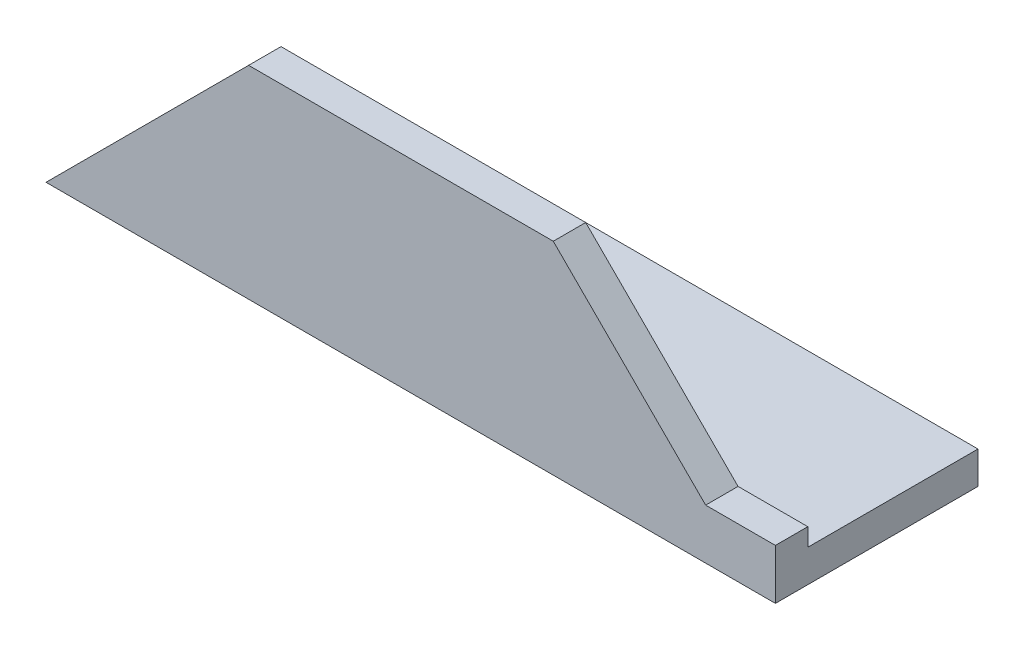
ISO-10303-21;
HEADER;
FILE_DESCRIPTION(('STEP AP214'),'2;1');
FILE_NAME('part.step','',(''),(''),'','','');
FILE_SCHEMA(('AUTOMOTIVE_DESIGN { 1 0 10303 214 1 1 1 1 }'));
ENDSEC;
DATA;
#1=APPLICATION_CONTEXT('core data for automotive mechanical design processes');
#2=APPLICATION_PROTOCOL_DEFINITION('international standard','automotive_design',2000,#1);
#3=PRODUCT_CONTEXT('',#1,'mechanical');
#4=PRODUCT('Part','Part','',(#3));
#5=PRODUCT_RELATED_PRODUCT_CATEGORY('part','',(#4));
#6=PRODUCT_DEFINITION_FORMATION('','',#4);
#7=PRODUCT_DEFINITION_CONTEXT('part definition',#1,'design');
#8=PRODUCT_DEFINITION('design','',#6,#7);
#9=PRODUCT_DEFINITION_SHAPE('','',#8);
#10=(LENGTH_UNIT() NAMED_UNIT(*) SI_UNIT(.MILLI.,.METRE.));
#11=(NAMED_UNIT(*) PLANE_ANGLE_UNIT() SI_UNIT($,.RADIAN.));
#12=(NAMED_UNIT(*) SI_UNIT($,.STERADIAN.) SOLID_ANGLE_UNIT());
#13=UNCERTAINTY_MEASURE_WITH_UNIT(LENGTH_MEASURE(1.E-05),#10,'distance_accuracy_value','');
#14=(GEOMETRIC_REPRESENTATION_CONTEXT(3) GLOBAL_UNCERTAINTY_ASSIGNED_CONTEXT((#13)) GLOBAL_UNIT_ASSIGNED_CONTEXT((#10,
#11,#12)) REPRESENTATION_CONTEXT('',''));
#15=CARTESIAN_POINT('',(0.,0.,0.));
#16=DIRECTION('',(0.,0.,1.));
#17=DIRECTION('',(1.,0.,0.));
#18=AXIS2_PLACEMENT_3D('',#15,#16,#17);
#19=CARTESIAN_POINT('',(90.,0.,-4.));
#20=DIRECTION('',(0.,0.,1.));
#21=DIRECTION('',(1.,0.,0.));
#22=AXIS2_PLACEMENT_3D('',#19,#20,#21);
#23=PLANE('',#22);
#24=DIRECTION('',(0.707106781186547,-0.707106781186547,0.));
#25=VECTOR('',#24,1.);
#26=CARTESIAN_POINT('',(88.7969572735896,-1.20304272641038,-4.));
#27=LINE('',#26,#25);
#28=CARTESIAN_POINT('',(62.5939145471792,25.,-4.));
#29=VERTEX_POINT('',#28);
#30=CARTESIAN_POINT('',(81.3946108479675,6.19930369921177,-4.));
#31=VERTEX_POINT('',#30);
#32=EDGE_CURVE('E166',#29,#31,#27,.T.);
#33=ORIENTED_EDGE('',*,*,#32,.T.);
#34=DIRECTION('',(1.,0.,0.));
#35=VECTOR('',#34,1.);
#36=CARTESIAN_POINT('',(90.,6.19930369921177,-4.));
#37=LINE('',#36,#35);
#38=CARTESIAN_POINT('',(90.,6.19930369921177,-4.));
#39=VERTEX_POINT('',#38);
#40=EDGE_CURVE('E172',#31,#39,#37,.T.);
#41=ORIENTED_EDGE('',*,*,#40,.T.);
#42=DIRECTION('',(0.,1.,0.));
#43=VECTOR('',#42,1.);
#44=CARTESIAN_POINT('',(90.,0.,-4.));
#45=LINE('',#44,#43);
#46=CARTESIAN_POINT('',(90.,4.,-4.));
#47=VERTEX_POINT('',#46);
#48=EDGE_CURVE('E114',#47,#39,#45,.T.);
#49=ORIENTED_EDGE('',*,*,#48,.F.);
#50=DIRECTION('',(-1.,0.,0.));
#51=VECTOR('',#50,1.);
#52=CARTESIAN_POINT('',(90.,4.,-4.));
#53=LINE('',#52,#51);
#54=CARTESIAN_POINT('',(4.00000000000003,4.,-4.));
#55=VERTEX_POINT('',#54);
#56=EDGE_CURVE('E109',#47,#55,#53,.T.);
#57=ORIENTED_EDGE('',*,*,#56,.T.);
#58=DIRECTION('',(0.707106781186551,0.707106781186544,0.));
#59=VECTOR('',#58,1.);
#60=CARTESIAN_POINT('',(45.0000000000005,45.,-4.));
#61=LINE('',#60,#59);
#62=CARTESIAN_POINT('',(25.0000000000003,25.,-4.));
#63=VERTEX_POINT('',#62);
#64=EDGE_CURVE('E79',#55,#63,#61,.T.);
#65=ORIENTED_EDGE('',*,*,#64,.T.);
#66=DIRECTION('',(-1.,0.,0.));
#67=VECTOR('',#66,1.);
#68=CARTESIAN_POINT('',(90.,25.,-4.));
#69=LINE('',#68,#67);
#70=EDGE_CURVE('E41',#29,#63,#69,.T.);
#71=ORIENTED_EDGE('',*,*,#70,.F.);
#72=EDGE_LOOP('',(#33,#41,#49,#57,#65,#71));
#73=FACE_BOUND('',#72,.T.);
#74=ADVANCED_FACE('F34',(#73),#23,.F.);
#75=CARTESIAN_POINT('',(90.,25.,0.));
#76=DIRECTION('',(0.,1.,0.));
#77=DIRECTION('',(0.,0.,1.));
#78=AXIS2_PLACEMENT_3D('',#75,#76,#77);
#79=PLANE('',#78);
#80=DIRECTION('',(0.,0.,1.));
#81=VECTOR('',#80,1.);
#82=CARTESIAN_POINT('',(62.5939145471792,25.,-25.));
#83=LINE('',#82,#81);
#84=CARTESIAN_POINT('',(62.5939145471792,25.,0.));
#85=VERTEX_POINT('',#84);
#86=EDGE_CURVE('E131',#29,#85,#83,.T.);
#87=ORIENTED_EDGE('',*,*,#86,.F.);
#88=ORIENTED_EDGE('',*,*,#70,.T.);
#89=DIRECTION('',(0.,0.,1.));
#90=VECTOR('',#89,1.);
#91=CARTESIAN_POINT('',(25.0000000000003,25.,-25.));
#92=LINE('',#91,#90);
#93=CARTESIAN_POINT('',(25.0000000000003,25.,0.));
#94=VERTEX_POINT('',#93);
#95=EDGE_CURVE('E128',#63,#94,#92,.T.);
#96=ORIENTED_EDGE('',*,*,#95,.T.);
#97=DIRECTION('',(-1.,0.,0.));
#98=VECTOR('',#97,1.);
#99=CARTESIAN_POINT('',(90.,25.,0.));
#100=LINE('',#99,#98);
#101=EDGE_CURVE('E119',#85,#94,#100,.T.);
#102=ORIENTED_EDGE('',*,*,#101,.F.);
#103=EDGE_LOOP('',(#87,#88,#96,#102));
#104=FACE_BOUND('',#103,.T.);
#105=ADVANCED_FACE('F125',(#104),#79,.T.);
#106=CARTESIAN_POINT('',(90.,0.,0.));
#107=DIRECTION('',(0.,0.,1.));
#108=DIRECTION('',(1.,0.,0.));
#109=AXIS2_PLACEMENT_3D('',#106,#107,#108);
#110=PLANE('',#109);
#111=DIRECTION('',(1.,0.,0.));
#112=VECTOR('',#111,1.);
#113=CARTESIAN_POINT('',(90.,6.19930369921177,0.));
#114=LINE('',#113,#112);
#115=CARTESIAN_POINT('',(81.3946108479675,6.19930369921177,0.));
#116=VERTEX_POINT('',#115);
#117=CARTESIAN_POINT('',(90.,6.19930369921177,0.));
#118=VERTEX_POINT('',#117);
#119=EDGE_CURVE('E48',#116,#118,#114,.T.);
#120=ORIENTED_EDGE('',*,*,#119,.F.);
#121=DIRECTION('',(0.707106781186547,-0.707106781186547,0.));
#122=VECTOR('',#121,1.);
#123=CARTESIAN_POINT('',(81.3946108479675,6.19930369921177,0.));
#124=LINE('',#123,#122);
#125=EDGE_CURVE('E165',#85,#116,#124,.T.);
#126=ORIENTED_EDGE('',*,*,#125,.F.);
#127=ORIENTED_EDGE('',*,*,#101,.T.);
#128=DIRECTION('',(0.707106781186551,0.707106781186544,0.));
#129=VECTOR('',#128,1.);
#130=CARTESIAN_POINT('',(25.0000000000003,25.,0.));
#131=LINE('',#130,#129);
#132=CARTESIAN_POINT('',(0.,0.,0.));
#133=VERTEX_POINT('',#132);
#134=EDGE_CURVE('E137',#133,#94,#131,.T.);
#135=ORIENTED_EDGE('',*,*,#134,.F.);
#136=DIRECTION('',(-1.,0.,0.));
#137=VECTOR('',#136,1.);
#138=CARTESIAN_POINT('',(90.,0.,0.));
#139=LINE('',#138,#137);
#140=CARTESIAN_POINT('',(90.,0.,0.));
#141=VERTEX_POINT('',#140);
#142=EDGE_CURVE('E97',#141,#133,#139,.T.);
#143=ORIENTED_EDGE('',*,*,#142,.F.);
#144=DIRECTION('',(0.,1.,0.));
#145=VECTOR('',#144,1.);
#146=CARTESIAN_POINT('',(90.,0.,0.));
#147=LINE('',#146,#145);
#148=EDGE_CURVE('E104',#141,#118,#147,.T.);
#149=ORIENTED_EDGE('',*,*,#148,.T.);
#150=EDGE_LOOP('',(#120,#126,#127,#135,#143,#149));
#151=FACE_BOUND('',#150,.T.);
#152=ADVANCED_FACE('F145',(#151),#110,.T.);
#153=CARTESIAN_POINT('',(90.,0.,0.));
#154=DIRECTION('',(0.,-1.,0.));
#155=DIRECTION('',(0.,0.,-1.));
#156=AXIS2_PLACEMENT_3D('',#153,#154,#155);
#157=PLANE('',#156);
#158=DIRECTION('',(0.,0.,1.));
#159=VECTOR('',#158,1.);
#160=CARTESIAN_POINT('',(0.,0.,0.));
#161=LINE('',#160,#159);
#162=CARTESIAN_POINT('',(0.,0.,-25.));
#163=VERTEX_POINT('',#162);
#164=EDGE_CURVE('E94',#163,#133,#161,.T.);
#165=ORIENTED_EDGE('',*,*,#164,.F.);
#166=DIRECTION('',(-1.,0.,0.));
#167=VECTOR('',#166,1.);
#168=CARTESIAN_POINT('',(90.,0.,-25.));
#169=LINE('',#168,#167);
#170=CARTESIAN_POINT('',(90.,0.,-25.));
#171=VERTEX_POINT('',#170);
#172=EDGE_CURVE('E89',#171,#163,#169,.T.);
#173=ORIENTED_EDGE('',*,*,#172,.F.);
#174=DIRECTION('',(0.,0.,1.));
#175=VECTOR('',#174,1.);
#176=CARTESIAN_POINT('',(90.,0.,0.));
#177=LINE('',#176,#175);
#178=EDGE_CURVE('E93',#171,#141,#177,.T.);
#179=ORIENTED_EDGE('',*,*,#178,.T.);
#180=ORIENTED_EDGE('',*,*,#142,.T.);
#181=EDGE_LOOP('',(#165,#173,#179,#180));
#182=FACE_BOUND('',#181,.T.);
#183=ADVANCED_FACE('F91',(#182),#157,.T.);
#184=CARTESIAN_POINT('',(90.,4.,-25.));
#185=DIRECTION('',(0.,0.,-1.));
#186=DIRECTION('',(-1.,0.,0.));
#187=AXIS2_PLACEMENT_3D('',#184,#185,#186);
#188=PLANE('',#187);
#189=DIRECTION('',(0.707106781186551,0.707106781186544,0.));
#190=VECTOR('',#189,1.);
#191=CARTESIAN_POINT('',(25.0000000000003,25.,-25.));
#192=LINE('',#191,#190);
#193=CARTESIAN_POINT('',(4.00000000000004,4.,-25.));
#194=VERTEX_POINT('',#193);
#195=EDGE_CURVE('E70',#163,#194,#192,.T.);
#196=ORIENTED_EDGE('',*,*,#195,.T.);
#197=DIRECTION('',(-1.,0.,0.));
#198=VECTOR('',#197,1.);
#199=CARTESIAN_POINT('',(90.,4.,-25.));
#200=LINE('',#199,#198);
#201=CARTESIAN_POINT('',(90.,4.,-25.));
#202=VERTEX_POINT('',#201);
#203=EDGE_CURVE('E98',#202,#194,#200,.T.);
#204=ORIENTED_EDGE('',*,*,#203,.F.);
#205=DIRECTION('',(0.,-1.,0.));
#206=VECTOR('',#205,1.);
#207=CARTESIAN_POINT('',(90.,4.,-25.));
#208=LINE('',#207,#206);
#209=EDGE_CURVE('E102',#202,#171,#208,.T.);
#210=ORIENTED_EDGE('',*,*,#209,.T.);
#211=ORIENTED_EDGE('',*,*,#172,.T.);
#212=EDGE_LOOP('',(#196,#204,#210,#211));
#213=FACE_BOUND('',#212,.T.);
#214=ADVANCED_FACE('F106',(#213),#188,.T.);
#215=CARTESIAN_POINT('',(90.,4.,0.));
#216=DIRECTION('',(0.,-1.,0.));
#217=DIRECTION('',(0.,0.,-1.));
#218=AXIS2_PLACEMENT_3D('',#215,#216,#217);
#219=PLANE('',#218);
#220=ORIENTED_EDGE('',*,*,#203,.T.);
#221=DIRECTION('',(0.,0.,1.));
#222=VECTOR('',#221,1.);
#223=CARTESIAN_POINT('',(4.00000000000003,4.,0.));
#224=LINE('',#223,#222);
#225=EDGE_CURVE('E138',#194,#55,#224,.T.);
#226=ORIENTED_EDGE('',*,*,#225,.T.);
#227=ORIENTED_EDGE('',*,*,#56,.F.);
#228=DIRECTION('',(0.,0.,-1.));
#229=VECTOR('',#228,1.);
#230=CARTESIAN_POINT('',(90.,4.,0.));
#231=LINE('',#230,#229);
#232=EDGE_CURVE('E56',#202,#47,#231,.F.);
#233=ORIENTED_EDGE('',*,*,#232,.F.);
#234=EDGE_LOOP('',(#220,#226,#227,#233));
#235=FACE_BOUND('',#234,.T.);
#236=ADVANCED_FACE('F179',(#235),#219,.F.);
#237=CARTESIAN_POINT('',(90.,0.,0.));
#238=DIRECTION('',(-1.,0.,0.));
#239=DIRECTION('',(0.,0.,1.));
#240=AXIS2_PLACEMENT_3D('',#237,#238,#239);
#241=PLANE('',#240);
#242=ORIENTED_EDGE('',*,*,#48,.T.);
#243=DIRECTION('',(0.,0.,1.));
#244=VECTOR('',#243,1.);
#245=CARTESIAN_POINT('',(90.,6.19930369921177,0.));
#246=LINE('',#245,#244);
#247=EDGE_CURVE('E11',#39,#118,#246,.T.);
#248=ORIENTED_EDGE('',*,*,#247,.T.);
#249=ORIENTED_EDGE('',*,*,#148,.F.);
#250=ORIENTED_EDGE('',*,*,#178,.F.);
#251=ORIENTED_EDGE('',*,*,#209,.F.);
#252=ORIENTED_EDGE('',*,*,#232,.T.);
#253=EDGE_LOOP('',(#242,#248,#249,#250,#251,#252));
#254=FACE_BOUND('',#253,.T.);
#255=ADVANCED_FACE('F101',(#254),#241,.F.);
#256=CARTESIAN_POINT('',(25.0000000000003,25.,-25.));
#257=DIRECTION('',(0.707106781186544,-0.707106781186551,0.));
#258=DIRECTION('',(0.707106781186551,0.707106781186544,0.));
#259=AXIS2_PLACEMENT_3D('',#256,#257,#258);
#260=PLANE('',#259);
#261=ORIENTED_EDGE('',*,*,#225,.F.);
#262=ORIENTED_EDGE('',*,*,#195,.F.);
#263=ORIENTED_EDGE('',*,*,#164,.T.);
#264=ORIENTED_EDGE('',*,*,#134,.T.);
#265=ORIENTED_EDGE('',*,*,#95,.F.);
#266=ORIENTED_EDGE('',*,*,#64,.F.);
#267=EDGE_LOOP('',(#261,#262,#263,#264,#265,#266));
#268=FACE_BOUND('',#267,.T.);
#269=ADVANCED_FACE('F135',(#268),#260,.F.);
#270=CARTESIAN_POINT('',(81.3946108479675,6.19930369921177,-25.));
#271=DIRECTION('',(-0.707106781186547,-0.707106781186547,0.));
#272=DIRECTION('',(0.707106781186548,-0.707106781186548,0.));
#273=AXIS2_PLACEMENT_3D('',#270,#271,#272);
#274=PLANE('',#273);
#275=ORIENTED_EDGE('',*,*,#86,.T.);
#276=ORIENTED_EDGE('',*,*,#125,.T.);
#277=DIRECTION('',(0.,0.,1.));
#278=VECTOR('',#277,1.);
#279=CARTESIAN_POINT('',(81.3946108479675,6.19930369921177,-25.));
#280=LINE('',#279,#278);
#281=EDGE_CURVE('E167',#31,#116,#280,.T.);
#282=ORIENTED_EDGE('',*,*,#281,.F.);
#283=ORIENTED_EDGE('',*,*,#32,.F.);
#284=EDGE_LOOP('',(#275,#276,#282,#283));
#285=FACE_BOUND('',#284,.T.);
#286=ADVANCED_FACE('F163',(#285),#274,.F.);
#287=CARTESIAN_POINT('',(90.,6.19930369921177,-25.));
#288=DIRECTION('',(0.,-1.,0.));
#289=DIRECTION('',(0.,0.,-1.));
#290=AXIS2_PLACEMENT_3D('',#287,#288,#289);
#291=PLANE('',#290);
#292=ORIENTED_EDGE('',*,*,#281,.T.);
#293=ORIENTED_EDGE('',*,*,#119,.T.);
#294=ORIENTED_EDGE('',*,*,#247,.F.);
#295=ORIENTED_EDGE('',*,*,#40,.F.);
#296=EDGE_LOOP('',(#292,#293,#294,#295));
#297=FACE_BOUND('',#296,.T.);
#298=ADVANCED_FACE('F180',(#297),#291,.F.);
#299=CLOSED_SHELL('',(#74,#105,#152,#183,#214,#236,#255,#269,#286,#298));
#300=MANIFOLD_SOLID_BREP('B2',#299);
#301=ADVANCED_BREP_SHAPE_REPRESENTATION('',(#18,#300),#14);
#302=SHAPE_DEFINITION_REPRESENTATION(#9,#301);
ENDSEC;
END-ISO-10303-21;
